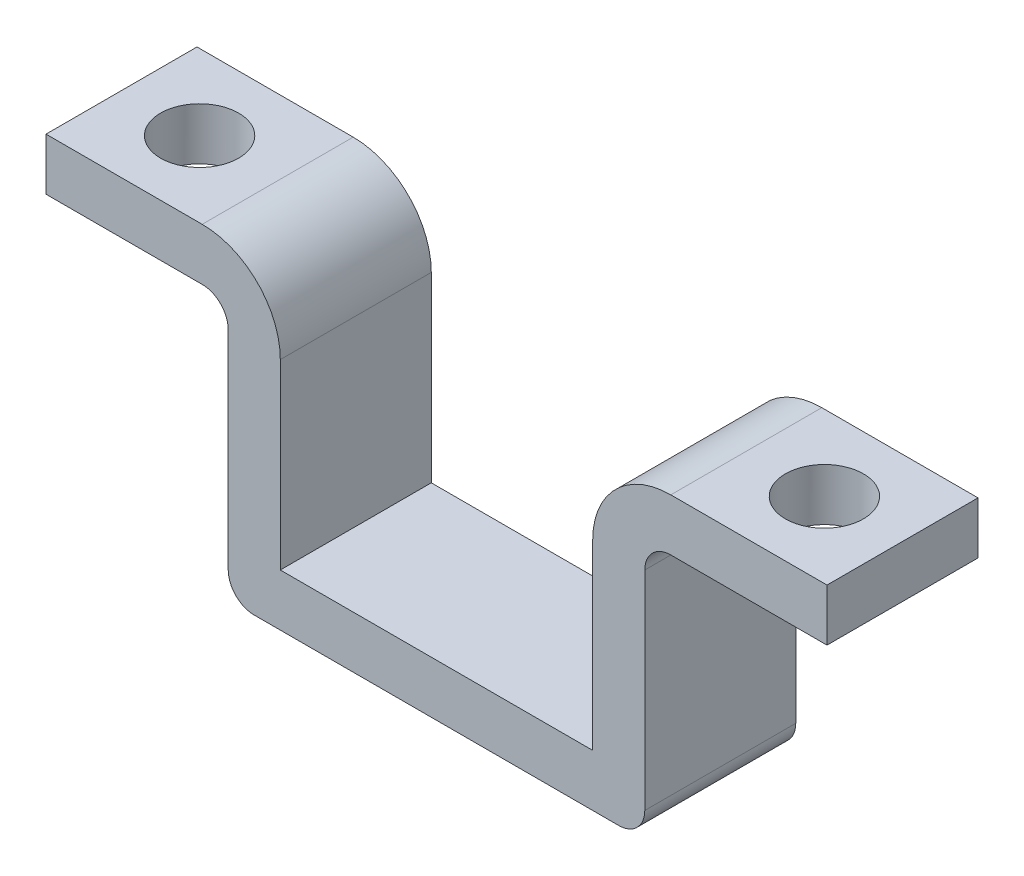
ISO-10303-21;
HEADER;
FILE_DESCRIPTION(('STEP AP214'),'2;1');
FILE_NAME('part.step','',(''),(''),'','','');
FILE_SCHEMA(('AUTOMOTIVE_DESIGN { 1 0 10303 214 1 1 1 1 }'));
ENDSEC;
DATA;
#1=APPLICATION_CONTEXT('core data for automotive mechanical design processes');
#2=APPLICATION_PROTOCOL_DEFINITION('international standard','automotive_design',2000,#1);
#3=PRODUCT_CONTEXT('',#1,'mechanical');
#4=PRODUCT('Part','Part','',(#3));
#5=PRODUCT_RELATED_PRODUCT_CATEGORY('part','',(#4));
#6=PRODUCT_DEFINITION_FORMATION('','',#4);
#7=PRODUCT_DEFINITION_CONTEXT('part definition',#1,'design');
#8=PRODUCT_DEFINITION('design','',#6,#7);
#9=PRODUCT_DEFINITION_SHAPE('','',#8);
#10=(LENGTH_UNIT() NAMED_UNIT(*) SI_UNIT(.MILLI.,.METRE.));
#11=(NAMED_UNIT(*) PLANE_ANGLE_UNIT() SI_UNIT($,.RADIAN.));
#12=(NAMED_UNIT(*) SI_UNIT($,.STERADIAN.) SOLID_ANGLE_UNIT());
#13=UNCERTAINTY_MEASURE_WITH_UNIT(LENGTH_MEASURE(1.E-05),#10,'distance_accuracy_value','');
#14=(GEOMETRIC_REPRESENTATION_CONTEXT(3) GLOBAL_UNCERTAINTY_ASSIGNED_CONTEXT((#13)) GLOBAL_UNIT_ASSIGNED_CONTEXT((#10,
#11,#12)) REPRESENTATION_CONTEXT('',''));
#15=CARTESIAN_POINT('',(0.,0.,0.));
#16=DIRECTION('',(0.,0.,1.));
#17=DIRECTION('',(1.,0.,0.));
#18=AXIS2_PLACEMENT_3D('',#15,#16,#17);
#19=CARTESIAN_POINT('',(-6.,-5.,2.9));
#20=DIRECTION('',(-1.,0.,0.));
#21=DIRECTION('',(0.,0.,1.));
#22=AXIS2_PLACEMENT_3D('',#19,#20,#21);
#23=PLANE('',#22);
#24=DIRECTION('',(0.,1.,0.));
#25=VECTOR('',#24,1.);
#26=CARTESIAN_POINT('',(-6.,-5.,-2.9));
#27=LINE('',#26,#25);
#28=CARTESIAN_POINT('',(-6.,-5.,-2.9));
#29=VERTEX_POINT('',#28);
#30=CARTESIAN_POINT('',(-6.,2.,-2.9));
#31=VERTEX_POINT('',#30);
#32=EDGE_CURVE('E189',#29,#31,#27,.T.);
#33=ORIENTED_EDGE('',*,*,#32,.T.);
#34=DIRECTION('',(0.,0.,-1.));
#35=VECTOR('',#34,1.);
#36=CARTESIAN_POINT('',(-6.,2.,2.9));
#37=LINE('',#36,#35);
#38=CARTESIAN_POINT('',(-6.,2.,2.9));
#39=VERTEX_POINT('',#38);
#40=EDGE_CURVE('E11',#39,#31,#37,.T.);
#41=ORIENTED_EDGE('',*,*,#40,.F.);
#42=DIRECTION('',(0.,1.,0.));
#43=VECTOR('',#42,1.);
#44=CARTESIAN_POINT('',(-6.,-5.,2.9));
#45=LINE('',#44,#43);
#46=CARTESIAN_POINT('',(-6.,-5.,2.9));
#47=VERTEX_POINT('',#46);
#48=EDGE_CURVE('E223',#47,#39,#45,.T.);
#49=ORIENTED_EDGE('',*,*,#48,.F.);
#50=DIRECTION('',(0.,0.,-1.));
#51=VECTOR('',#50,1.);
#52=CARTESIAN_POINT('',(-6.,-5.,2.9));
#53=LINE('',#52,#51);
#54=EDGE_CURVE('E185',#47,#29,#53,.T.);
#55=ORIENTED_EDGE('',*,*,#54,.T.);
#56=EDGE_LOOP('',(#33,#41,#49,#55));
#57=FACE_BOUND('',#56,.T.);
#58=ADVANCED_FACE('F32',(#57),#23,.F.);
#59=CARTESIAN_POINT('',(-9.00000000000001,2.,2.9));
#60=DIRECTION('',(0.,0.,-1.));
#61=DIRECTION('',(-1.,0.,0.));
#62=AXIS2_PLACEMENT_3D('',#59,#60,#61);
#63=CYLINDRICAL_SURFACE('',#62,3.);
#64=CARTESIAN_POINT('',(-9.00000000000001,2.,-2.9));
#65=DIRECTION('',(0.,0.,1.));
#66=DIRECTION('',(1.,0.,0.));
#67=AXIS2_PLACEMENT_3D('',#64,#65,#66);
#68=CIRCLE('',#67,3.);
#69=CARTESIAN_POINT('',(-9.00000000000001,5.,-2.9));
#70=VERTEX_POINT('',#69);
#71=EDGE_CURVE('E192',#31,#70,#68,.T.);
#72=ORIENTED_EDGE('',*,*,#71,.T.);
#73=DIRECTION('',(0.,0.,-1.));
#74=VECTOR('',#73,1.);
#75=CARTESIAN_POINT('',(-9.00000000000001,5.,2.9));
#76=LINE('',#75,#74);
#77=CARTESIAN_POINT('',(-9.00000000000001,5.,2.9));
#78=VERTEX_POINT('',#77);
#79=EDGE_CURVE('E41',#78,#70,#76,.T.);
#80=ORIENTED_EDGE('',*,*,#79,.F.);
#81=CARTESIAN_POINT('',(-9.00000000000001,2.,2.9));
#82=DIRECTION('',(0.,0.,1.));
#83=DIRECTION('',(1.,0.,0.));
#84=AXIS2_PLACEMENT_3D('',#81,#82,#83);
#85=CIRCLE('',#84,3.);
#86=EDGE_CURVE('E122',#39,#78,#85,.T.);
#87=ORIENTED_EDGE('',*,*,#86,.F.);
#88=ORIENTED_EDGE('',*,*,#40,.T.);
#89=EDGE_LOOP('',(#72,#80,#87,#88));
#90=FACE_BOUND('',#89,.T.);
#91=ADVANCED_FACE('F332',(#90),#63,.T.);
#92=CARTESIAN_POINT('',(-15.,5.,2.9));
#93=DIRECTION('',(0.,-1.,0.));
#94=DIRECTION('',(0.,0.,-1.));
#95=AXIS2_PLACEMENT_3D('',#92,#93,#94);
#96=PLANE('',#95);
#97=CARTESIAN_POINT('',(-12.,5.,0.));
#98=DIRECTION('',(0.,1.,0.));
#99=DIRECTION('',(0.,0.,1.));
#100=AXIS2_PLACEMENT_3D('',#97,#98,#99);
#101=CIRCLE('',#100,1.5);
#102=CARTESIAN_POINT('',(-12.,5.,1.5));
#103=VERTEX_POINT('',#102);
#104=EDGE_CURVE('E465',#103,#103,#101,.T.);
#105=ORIENTED_EDGE('',*,*,#104,.F.);
#106=EDGE_LOOP('',(#105));
#107=FACE_BOUND('',#106,.T.);
#108=DIRECTION('',(-1.,0.,0.));
#109=VECTOR('',#108,1.);
#110=CARTESIAN_POINT('',(-15.,5.,-2.9));
#111=LINE('',#110,#109);
#112=CARTESIAN_POINT('',(-15.,5.,-2.9));
#113=VERTEX_POINT('',#112);
#114=EDGE_CURVE('E194',#70,#113,#111,.T.);
#115=ORIENTED_EDGE('',*,*,#114,.T.);
#116=DIRECTION('',(0.,0.,-1.));
#117=VECTOR('',#116,1.);
#118=CARTESIAN_POINT('',(-15.,5.,2.9));
#119=LINE('',#118,#117);
#120=CARTESIAN_POINT('',(-15.,5.,2.9));
#121=VERTEX_POINT('',#120);
#122=EDGE_CURVE('E260',#121,#113,#119,.T.);
#123=ORIENTED_EDGE('',*,*,#122,.F.);
#124=DIRECTION('',(-1.,0.,0.));
#125=VECTOR('',#124,1.);
#126=CARTESIAN_POINT('',(-15.,5.,2.9));
#127=LINE('',#126,#125);
#128=EDGE_CURVE('E269',#78,#121,#127,.T.);
#129=ORIENTED_EDGE('',*,*,#128,.F.);
#130=ORIENTED_EDGE('',*,*,#79,.T.);
#131=EDGE_LOOP('',(#115,#123,#129,#130));
#132=FACE_BOUND('',#131,.T.);
#133=ADVANCED_FACE('F267',(#107,#132),#96,.F.);
#134=CARTESIAN_POINT('',(-15.,3.,2.9));
#135=DIRECTION('',(1.,0.,0.));
#136=DIRECTION('',(0.,0.,-1.));
#137=AXIS2_PLACEMENT_3D('',#134,#135,#136);
#138=PLANE('',#137);
#139=DIRECTION('',(0.,-1.,0.));
#140=VECTOR('',#139,1.);
#141=CARTESIAN_POINT('',(-15.,3.,-2.9));
#142=LINE('',#141,#140);
#143=CARTESIAN_POINT('',(-15.,3.,-2.9));
#144=VERTEX_POINT('',#143);
#145=EDGE_CURVE('E196',#113,#144,#142,.T.);
#146=ORIENTED_EDGE('',*,*,#145,.T.);
#147=DIRECTION('',(0.,0.,-1.));
#148=VECTOR('',#147,1.);
#149=CARTESIAN_POINT('',(-15.,3.,2.9));
#150=LINE('',#149,#148);
#151=CARTESIAN_POINT('',(-15.,3.,2.9));
#152=VERTEX_POINT('',#151);
#153=EDGE_CURVE('E257',#152,#144,#150,.T.);
#154=ORIENTED_EDGE('',*,*,#153,.F.);
#155=DIRECTION('',(0.,-1.,0.));
#156=VECTOR('',#155,1.);
#157=CARTESIAN_POINT('',(-15.,3.,2.9));
#158=LINE('',#157,#156);
#159=EDGE_CURVE('E287',#121,#152,#158,.T.);
#160=ORIENTED_EDGE('',*,*,#159,.F.);
#161=ORIENTED_EDGE('',*,*,#122,.T.);
#162=EDGE_LOOP('',(#146,#154,#160,#161));
#163=FACE_BOUND('',#162,.T.);
#164=ADVANCED_FACE('F278',(#163),#138,.F.);
#165=CARTESIAN_POINT('',(-9.00000000000001,3.,2.9));
#166=DIRECTION('',(0.,1.,0.));
#167=DIRECTION('',(-1.,0.,0.));
#168=AXIS2_PLACEMENT_3D('',#165,#166,#167);
#169=PLANE('',#168);
#170=CARTESIAN_POINT('',(-12.,3.,0.));
#171=DIRECTION('',(0.,1.,0.));
#172=DIRECTION('',(-1.,0.,0.));
#173=AXIS2_PLACEMENT_3D('',#170,#171,#172);
#174=CIRCLE('',#173,1.5);
#175=CARTESIAN_POINT('',(-13.5,3.,0.));
#176=VERTEX_POINT('',#175);
#177=EDGE_CURVE('E35',#176,#176,#174,.T.);
#178=ORIENTED_EDGE('',*,*,#177,.T.);
#179=EDGE_LOOP('',(#178));
#180=FACE_BOUND('',#179,.T.);
#181=DIRECTION('',(1.,0.,0.));
#182=VECTOR('',#181,1.);
#183=CARTESIAN_POINT('',(-9.00000000000001,3.,-2.9));
#184=LINE('',#183,#182);
#185=CARTESIAN_POINT('',(-9.00000000000001,3.,-2.9));
#186=VERTEX_POINT('',#185);
#187=EDGE_CURVE('E198',#144,#186,#184,.T.);
#188=ORIENTED_EDGE('',*,*,#187,.T.);
#189=DIRECTION('',(0.,0.,-1.));
#190=VECTOR('',#189,1.);
#191=CARTESIAN_POINT('',(-9.00000000000001,3.,2.9));
#192=LINE('',#191,#190);
#193=CARTESIAN_POINT('',(-9.00000000000001,3.,2.9));
#194=VERTEX_POINT('',#193);
#195=EDGE_CURVE('E254',#194,#186,#192,.T.);
#196=ORIENTED_EDGE('',*,*,#195,.F.);
#197=DIRECTION('',(1.,0.,0.));
#198=VECTOR('',#197,1.);
#199=CARTESIAN_POINT('',(-9.00000000000001,3.,2.9));
#200=LINE('',#199,#198);
#201=EDGE_CURVE('E284',#152,#194,#200,.T.);
#202=ORIENTED_EDGE('',*,*,#201,.F.);
#203=ORIENTED_EDGE('',*,*,#153,.T.);
#204=EDGE_LOOP('',(#188,#196,#202,#203));
#205=FACE_BOUND('',#204,.T.);
#206=ADVANCED_FACE('F282',(#180,#205),#169,.F.);
#207=CARTESIAN_POINT('',(-9.00000000000001,2.,2.9));
#208=DIRECTION('',(0.,0.,-1.));
#209=DIRECTION('',(-1.,0.,0.));
#210=AXIS2_PLACEMENT_3D('',#207,#208,#209);
#211=CYLINDRICAL_SURFACE('',#210,1.);
#212=CARTESIAN_POINT('',(-9.00000000000001,2.,-2.9));
#213=DIRECTION('',(0.,0.,-1.));
#214=DIRECTION('',(1.,0.,0.));
#215=AXIS2_PLACEMENT_3D('',#212,#213,#214);
#216=CIRCLE('',#215,1.);
#217=CARTESIAN_POINT('',(-8.,2.,-2.9));
#218=VERTEX_POINT('',#217);
#219=EDGE_CURVE('E200',#186,#218,#216,.T.);
#220=ORIENTED_EDGE('',*,*,#219,.T.);
#221=DIRECTION('',(0.,0.,-1.));
#222=VECTOR('',#221,1.);
#223=CARTESIAN_POINT('',(-8.,2.,2.9));
#224=LINE('',#223,#222);
#225=CARTESIAN_POINT('',(-8.,2.,2.9));
#226=VERTEX_POINT('',#225);
#227=EDGE_CURVE('E251',#226,#218,#224,.T.);
#228=ORIENTED_EDGE('',*,*,#227,.F.);
#229=CARTESIAN_POINT('',(-9.00000000000001,2.,2.9));
#230=DIRECTION('',(0.,0.,-1.));
#231=DIRECTION('',(1.,0.,0.));
#232=AXIS2_PLACEMENT_3D('',#229,#230,#231);
#233=CIRCLE('',#232,1.);
#234=EDGE_CURVE('E286',#194,#226,#233,.T.);
#235=ORIENTED_EDGE('',*,*,#234,.F.);
#236=ORIENTED_EDGE('',*,*,#195,.T.);
#237=EDGE_LOOP('',(#220,#228,#235,#236));
#238=FACE_BOUND('',#237,.T.);
#239=ADVANCED_FACE('F346',(#238),#211,.F.);
#240=CARTESIAN_POINT('',(-8.,-5.99999999999999,2.9));
#241=DIRECTION('',(1.,0.,0.));
#242=DIRECTION('',(0.,0.,-1.));
#243=AXIS2_PLACEMENT_3D('',#240,#241,#242);
#244=PLANE('',#243);
#245=DIRECTION('',(0.,-1.,0.));
#246=VECTOR('',#245,1.);
#247=CARTESIAN_POINT('',(-8.,-5.99999999999999,-2.9));
#248=LINE('',#247,#246);
#249=CARTESIAN_POINT('',(-8.,-6.,-2.9));
#250=VERTEX_POINT('',#249);
#251=EDGE_CURVE('E202',#218,#250,#248,.T.);
#252=ORIENTED_EDGE('',*,*,#251,.T.);
#253=DIRECTION('',(0.,0.,-1.));
#254=VECTOR('',#253,1.);
#255=CARTESIAN_POINT('',(-8.,-6.,2.9));
#256=LINE('',#255,#254);
#257=CARTESIAN_POINT('',(-8.,-6.,2.9));
#258=VERTEX_POINT('',#257);
#259=EDGE_CURVE('E248',#258,#250,#256,.T.);
#260=ORIENTED_EDGE('',*,*,#259,.F.);
#261=DIRECTION('',(0.,-1.,0.));
#262=VECTOR('',#261,1.);
#263=CARTESIAN_POINT('',(-8.,-5.99999999999999,2.9));
#264=LINE('',#263,#262);
#265=EDGE_CURVE('E289',#226,#258,#264,.T.);
#266=ORIENTED_EDGE('',*,*,#265,.F.);
#267=ORIENTED_EDGE('',*,*,#227,.T.);
#268=EDGE_LOOP('',(#252,#260,#266,#267));
#269=FACE_BOUND('',#268,.T.);
#270=ADVANCED_FACE('F350',(#269),#244,.F.);
#271=CARTESIAN_POINT('',(-7.,-6.,2.9));
#272=DIRECTION('',(0.,0.,-1.));
#273=DIRECTION('',(-1.,0.,0.));
#274=AXIS2_PLACEMENT_3D('',#271,#272,#273);
#275=CYLINDRICAL_SURFACE('',#274,1.);
#276=CARTESIAN_POINT('',(-7.,-6.,-2.9));
#277=DIRECTION('',(0.,0.,1.));
#278=DIRECTION('',(-1.,0.,0.));
#279=AXIS2_PLACEMENT_3D('',#276,#277,#278);
#280=CIRCLE('',#279,1.);
#281=CARTESIAN_POINT('',(-7.,-7.,-2.9));
#282=VERTEX_POINT('',#281);
#283=EDGE_CURVE('E204',#250,#282,#280,.T.);
#284=ORIENTED_EDGE('',*,*,#283,.T.);
#285=DIRECTION('',(0.,0.,-1.));
#286=VECTOR('',#285,1.);
#287=CARTESIAN_POINT('',(-7.,-7.,2.9));
#288=LINE('',#287,#286);
#289=CARTESIAN_POINT('',(-7.,-7.,2.9));
#290=VERTEX_POINT('',#289);
#291=EDGE_CURVE('E245',#290,#282,#288,.T.);
#292=ORIENTED_EDGE('',*,*,#291,.F.);
#293=CARTESIAN_POINT('',(-7.,-6.,2.9));
#294=DIRECTION('',(0.,0.,1.));
#295=DIRECTION('',(-1.,0.,0.));
#296=AXIS2_PLACEMENT_3D('',#293,#294,#295);
#297=CIRCLE('',#296,1.);
#298=EDGE_CURVE('E295',#258,#290,#297,.T.);
#299=ORIENTED_EDGE('',*,*,#298,.F.);
#300=ORIENTED_EDGE('',*,*,#259,.T.);
#301=EDGE_LOOP('',(#284,#292,#299,#300));
#302=FACE_BOUND('',#301,.T.);
#303=ADVANCED_FACE('F354',(#302),#275,.T.);
#304=CARTESIAN_POINT('',(-7.,-7.,2.9));
#305=DIRECTION('',(0.,1.,0.));
#306=DIRECTION('',(0.,0.,1.));
#307=AXIS2_PLACEMENT_3D('',#304,#305,#306);
#308=PLANE('',#307);
#309=DIRECTION('',(1.,0.,0.));
#310=VECTOR('',#309,1.);
#311=CARTESIAN_POINT('',(-7.,-7.,-2.9));
#312=LINE('',#311,#310);
#313=CARTESIAN_POINT('',(7.,-7.,-2.9));
#314=VERTEX_POINT('',#313);
#315=EDGE_CURVE('E206',#282,#314,#312,.T.);
#316=ORIENTED_EDGE('',*,*,#315,.T.);
#317=DIRECTION('',(0.,0.,-1.));
#318=VECTOR('',#317,1.);
#319=CARTESIAN_POINT('',(7.,-7.,2.9));
#320=LINE('',#319,#318);
#321=CARTESIAN_POINT('',(7.,-7.,2.9));
#322=VERTEX_POINT('',#321);
#323=EDGE_CURVE('E242',#322,#314,#320,.T.);
#324=ORIENTED_EDGE('',*,*,#323,.F.);
#325=DIRECTION('',(1.,0.,0.));
#326=VECTOR('',#325,1.);
#327=CARTESIAN_POINT('',(-7.,-7.,2.9));
#328=LINE('',#327,#326);
#329=EDGE_CURVE('E297',#290,#322,#328,.T.);
#330=ORIENTED_EDGE('',*,*,#329,.F.);
#331=ORIENTED_EDGE('',*,*,#291,.T.);
#332=EDGE_LOOP('',(#316,#324,#330,#331));
#333=FACE_BOUND('',#332,.T.);
#334=ADVANCED_FACE('F358',(#333),#308,.F.);
#335=CARTESIAN_POINT('',(7.,-6.,2.9));
#336=DIRECTION('',(0.,0.,-1.));
#337=DIRECTION('',(-1.,0.,0.));
#338=AXIS2_PLACEMENT_3D('',#335,#336,#337);
#339=CYLINDRICAL_SURFACE('',#338,1.);
#340=CARTESIAN_POINT('',(7.,-6.,-2.9));
#341=DIRECTION('',(0.,0.,1.));
#342=DIRECTION('',(-1.,0.,0.));
#343=AXIS2_PLACEMENT_3D('',#340,#341,#342);
#344=CIRCLE('',#343,1.);
#345=CARTESIAN_POINT('',(8.,-5.99999999999999,-2.9));
#346=VERTEX_POINT('',#345);
#347=EDGE_CURVE('E208',#314,#346,#344,.T.);
#348=ORIENTED_EDGE('',*,*,#347,.T.);
#349=DIRECTION('',(0.,0.,-1.));
#350=VECTOR('',#349,1.);
#351=CARTESIAN_POINT('',(8.,-5.99999999999999,2.9));
#352=LINE('',#351,#350);
#353=CARTESIAN_POINT('',(8.,-5.99999999999999,2.9));
#354=VERTEX_POINT('',#353);
#355=EDGE_CURVE('E239',#354,#346,#352,.T.);
#356=ORIENTED_EDGE('',*,*,#355,.F.);
#357=CARTESIAN_POINT('',(7.,-6.,2.9));
#358=DIRECTION('',(0.,0.,1.));
#359=DIRECTION('',(-1.,0.,0.));
#360=AXIS2_PLACEMENT_3D('',#357,#358,#359);
#361=CIRCLE('',#360,1.);
#362=EDGE_CURVE('E299',#322,#354,#361,.T.);
#363=ORIENTED_EDGE('',*,*,#362,.F.);
#364=ORIENTED_EDGE('',*,*,#323,.T.);
#365=EDGE_LOOP('',(#348,#356,#363,#364));
#366=FACE_BOUND('',#365,.T.);
#367=ADVANCED_FACE('F362',(#366),#339,.T.);
#368=CARTESIAN_POINT('',(8.,-5.99999999999999,2.9));
#369=DIRECTION('',(-1.,0.,0.));
#370=DIRECTION('',(0.,0.,1.));
#371=AXIS2_PLACEMENT_3D('',#368,#369,#370);
#372=PLANE('',#371);
#373=DIRECTION('',(0.,1.,0.));
#374=VECTOR('',#373,1.);
#375=CARTESIAN_POINT('',(8.,-5.99999999999999,-2.9));
#376=LINE('',#375,#374);
#377=CARTESIAN_POINT('',(8.,2.,-2.9));
#378=VERTEX_POINT('',#377);
#379=EDGE_CURVE('E210',#346,#378,#376,.T.);
#380=ORIENTED_EDGE('',*,*,#379,.T.);
#381=DIRECTION('',(0.,0.,-1.));
#382=VECTOR('',#381,1.);
#383=CARTESIAN_POINT('',(8.,2.,2.9));
#384=LINE('',#383,#382);
#385=CARTESIAN_POINT('',(8.,2.,2.9));
#386=VERTEX_POINT('',#385);
#387=EDGE_CURVE('E236',#386,#378,#384,.T.);
#388=ORIENTED_EDGE('',*,*,#387,.F.);
#389=DIRECTION('',(0.,1.,0.));
#390=VECTOR('',#389,1.);
#391=CARTESIAN_POINT('',(8.,-5.99999999999999,2.9));
#392=LINE('',#391,#390);
#393=EDGE_CURVE('E301',#354,#386,#392,.T.);
#394=ORIENTED_EDGE('',*,*,#393,.F.);
#395=ORIENTED_EDGE('',*,*,#355,.T.);
#396=EDGE_LOOP('',(#380,#388,#394,#395));
#397=FACE_BOUND('',#396,.T.);
#398=ADVANCED_FACE('F366',(#397),#372,.F.);
#399=CARTESIAN_POINT('',(9.00000000000001,2.,2.9));
#400=DIRECTION('',(0.,0.,-1.));
#401=DIRECTION('',(-1.,0.,0.));
#402=AXIS2_PLACEMENT_3D('',#399,#400,#401);
#403=CYLINDRICAL_SURFACE('',#402,1.);
#404=CARTESIAN_POINT('',(9.00000000000001,2.,-2.9));
#405=DIRECTION('',(0.,0.,-1.));
#406=DIRECTION('',(1.,0.,0.));
#407=AXIS2_PLACEMENT_3D('',#404,#405,#406);
#408=CIRCLE('',#407,1.);
#409=CARTESIAN_POINT('',(9.00000000000001,3.,-2.9));
#410=VERTEX_POINT('',#409);
#411=EDGE_CURVE('E212',#378,#410,#408,.T.);
#412=ORIENTED_EDGE('',*,*,#411,.T.);
#413=DIRECTION('',(0.,0.,-1.));
#414=VECTOR('',#413,1.);
#415=CARTESIAN_POINT('',(9.00000000000001,3.,2.9));
#416=LINE('',#415,#414);
#417=CARTESIAN_POINT('',(9.00000000000001,3.,2.9));
#418=VERTEX_POINT('',#417);
#419=EDGE_CURVE('E233',#418,#410,#416,.T.);
#420=ORIENTED_EDGE('',*,*,#419,.F.);
#421=CARTESIAN_POINT('',(9.00000000000001,2.,2.9));
#422=DIRECTION('',(0.,0.,-1.));
#423=DIRECTION('',(1.,0.,0.));
#424=AXIS2_PLACEMENT_3D('',#421,#422,#423);
#425=CIRCLE('',#424,1.);
#426=EDGE_CURVE('E303',#386,#418,#425,.T.);
#427=ORIENTED_EDGE('',*,*,#426,.F.);
#428=ORIENTED_EDGE('',*,*,#387,.T.);
#429=EDGE_LOOP('',(#412,#420,#427,#428));
#430=FACE_BOUND('',#429,.T.);
#431=ADVANCED_FACE('F370',(#430),#403,.F.);
#432=CARTESIAN_POINT('',(15.,3.,2.9));
#433=DIRECTION('',(0.,1.,0.));
#434=DIRECTION('',(-1.,0.,0.));
#435=AXIS2_PLACEMENT_3D('',#432,#433,#434);
#436=PLANE('',#435);
#437=CARTESIAN_POINT('',(12.,3.,0.));
#438=DIRECTION('',(0.,1.,0.));
#439=DIRECTION('',(-1.,0.,0.));
#440=AXIS2_PLACEMENT_3D('',#437,#438,#439);
#441=CIRCLE('',#440,1.5);
#442=CARTESIAN_POINT('',(10.5,3.,0.));
#443=VERTEX_POINT('',#442);
#444=EDGE_CURVE('E468',#443,#443,#441,.T.);
#445=ORIENTED_EDGE('',*,*,#444,.T.);
#446=EDGE_LOOP('',(#445));
#447=FACE_BOUND('',#446,.T.);
#448=DIRECTION('',(1.,0.,0.));
#449=VECTOR('',#448,1.);
#450=CARTESIAN_POINT('',(15.,3.,-2.9));
#451=LINE('',#450,#449);
#452=CARTESIAN_POINT('',(15.,3.,-2.9));
#453=VERTEX_POINT('',#452);
#454=EDGE_CURVE('E214',#410,#453,#451,.T.);
#455=ORIENTED_EDGE('',*,*,#454,.T.);
#456=DIRECTION('',(0.,0.,-1.));
#457=VECTOR('',#456,1.);
#458=CARTESIAN_POINT('',(15.,3.,2.9));
#459=LINE('',#458,#457);
#460=CARTESIAN_POINT('',(15.,3.,2.9));
#461=VERTEX_POINT('',#460);
#462=EDGE_CURVE('E230',#461,#453,#459,.T.);
#463=ORIENTED_EDGE('',*,*,#462,.F.);
#464=DIRECTION('',(1.,0.,0.));
#465=VECTOR('',#464,1.);
#466=CARTESIAN_POINT('',(15.,3.,2.9));
#467=LINE('',#466,#465);
#468=EDGE_CURVE('E305',#418,#461,#467,.T.);
#469=ORIENTED_EDGE('',*,*,#468,.F.);
#470=ORIENTED_EDGE('',*,*,#419,.T.);
#471=EDGE_LOOP('',(#455,#463,#469,#470));
#472=FACE_BOUND('',#471,.T.);
#473=ADVANCED_FACE('F374',(#447,#472),#436,.F.);
#474=CARTESIAN_POINT('',(15.,5.,2.9));
#475=DIRECTION('',(-1.,0.,0.));
#476=DIRECTION('',(0.,-1.,0.));
#477=AXIS2_PLACEMENT_3D('',#474,#475,#476);
#478=PLANE('',#477);
#479=DIRECTION('',(0.,1.,0.));
#480=VECTOR('',#479,1.);
#481=CARTESIAN_POINT('',(15.,5.,-2.9));
#482=LINE('',#481,#480);
#483=CARTESIAN_POINT('',(15.,5.,-2.9));
#484=VERTEX_POINT('',#483);
#485=EDGE_CURVE('E216',#453,#484,#482,.T.);
#486=ORIENTED_EDGE('',*,*,#485,.T.);
#487=DIRECTION('',(0.,0.,-1.));
#488=VECTOR('',#487,1.);
#489=CARTESIAN_POINT('',(15.,5.,2.9));
#490=LINE('',#489,#488);
#491=CARTESIAN_POINT('',(15.,5.,2.9));
#492=VERTEX_POINT('',#491);
#493=EDGE_CURVE('E227',#492,#484,#490,.T.);
#494=ORIENTED_EDGE('',*,*,#493,.F.);
#495=DIRECTION('',(0.,1.,0.));
#496=VECTOR('',#495,1.);
#497=CARTESIAN_POINT('',(15.,5.,2.9));
#498=LINE('',#497,#496);
#499=EDGE_CURVE('E307',#461,#492,#498,.T.);
#500=ORIENTED_EDGE('',*,*,#499,.F.);
#501=ORIENTED_EDGE('',*,*,#462,.T.);
#502=EDGE_LOOP('',(#486,#494,#500,#501));
#503=FACE_BOUND('',#502,.T.);
#504=ADVANCED_FACE('F313',(#503),#478,.F.);
#505=CARTESIAN_POINT('',(9.00000000000001,5.,2.9));
#506=DIRECTION('',(0.,-1.,0.));
#507=DIRECTION('',(0.,0.,-1.));
#508=AXIS2_PLACEMENT_3D('',#505,#506,#507);
#509=PLANE('',#508);
#510=CARTESIAN_POINT('',(12.,5.,0.));
#511=DIRECTION('',(0.,1.,0.));
#512=DIRECTION('',(0.,0.,1.));
#513=AXIS2_PLACEMENT_3D('',#510,#511,#512);
#514=CIRCLE('',#513,1.5);
#515=CARTESIAN_POINT('',(12.,5.,1.5));
#516=VERTEX_POINT('',#515);
#517=EDGE_CURVE('E470',#516,#516,#514,.T.);
#518=ORIENTED_EDGE('',*,*,#517,.F.);
#519=EDGE_LOOP('',(#518));
#520=FACE_BOUND('',#519,.T.);
#521=DIRECTION('',(-1.,0.,0.));
#522=VECTOR('',#521,1.);
#523=CARTESIAN_POINT('',(9.00000000000001,5.,-2.9));
#524=LINE('',#523,#522);
#525=CARTESIAN_POINT('',(9.00000000000001,5.,-2.9));
#526=VERTEX_POINT('',#525);
#527=EDGE_CURVE('E218',#484,#526,#524,.T.);
#528=ORIENTED_EDGE('',*,*,#527,.T.);
#529=DIRECTION('',(0.,0.,-1.));
#530=VECTOR('',#529,1.);
#531=CARTESIAN_POINT('',(9.00000000000001,5.,2.9));
#532=LINE('',#531,#530);
#533=CARTESIAN_POINT('',(9.00000000000001,5.,2.9));
#534=VERTEX_POINT('',#533);
#535=EDGE_CURVE('E180',#534,#526,#532,.T.);
#536=ORIENTED_EDGE('',*,*,#535,.F.);
#537=DIRECTION('',(-1.,0.,0.));
#538=VECTOR('',#537,1.);
#539=CARTESIAN_POINT('',(9.00000000000001,5.,2.9));
#540=LINE('',#539,#538);
#541=EDGE_CURVE('E171',#492,#534,#540,.T.);
#542=ORIENTED_EDGE('',*,*,#541,.F.);
#543=ORIENTED_EDGE('',*,*,#493,.T.);
#544=EDGE_LOOP('',(#528,#536,#542,#543));
#545=FACE_BOUND('',#544,.T.);
#546=ADVANCED_FACE('F317',(#520,#545),#509,.F.);
#547=CARTESIAN_POINT('',(9.00000000000001,2.,2.9));
#548=DIRECTION('',(0.,0.,-1.));
#549=DIRECTION('',(-1.,0.,0.));
#550=AXIS2_PLACEMENT_3D('',#547,#548,#549);
#551=CYLINDRICAL_SURFACE('',#550,3.);
#552=CARTESIAN_POINT('',(9.00000000000001,2.,-2.9));
#553=DIRECTION('',(0.,0.,1.));
#554=DIRECTION('',(1.,0.,0.));
#555=AXIS2_PLACEMENT_3D('',#552,#553,#554);
#556=CIRCLE('',#555,3.);
#557=CARTESIAN_POINT('',(6.,2.,-2.9));
#558=VERTEX_POINT('',#557);
#559=EDGE_CURVE('E179',#526,#558,#556,.T.);
#560=ORIENTED_EDGE('',*,*,#559,.T.);
#561=DIRECTION('',(0.,0.,-1.));
#562=VECTOR('',#561,1.);
#563=CARTESIAN_POINT('',(6.,2.,2.9));
#564=LINE('',#563,#562);
#565=CARTESIAN_POINT('',(6.,2.,2.9));
#566=VERTEX_POINT('',#565);
#567=EDGE_CURVE('E176',#566,#558,#564,.T.);
#568=ORIENTED_EDGE('',*,*,#567,.F.);
#569=CARTESIAN_POINT('',(9.00000000000001,2.,2.9));
#570=DIRECTION('',(0.,0.,1.));
#571=DIRECTION('',(1.,0.,0.));
#572=AXIS2_PLACEMENT_3D('',#569,#570,#571);
#573=CIRCLE('',#572,3.);
#574=EDGE_CURVE('E165',#534,#566,#573,.T.);
#575=ORIENTED_EDGE('',*,*,#574,.F.);
#576=ORIENTED_EDGE('',*,*,#535,.T.);
#577=EDGE_LOOP('',(#560,#568,#575,#576));
#578=FACE_BOUND('',#577,.T.);
#579=ADVANCED_FACE('F177',(#578),#551,.T.);
#580=CARTESIAN_POINT('',(6.,-5.,2.9));
#581=DIRECTION('',(1.,0.,0.));
#582=DIRECTION('',(0.,0.,-1.));
#583=AXIS2_PLACEMENT_3D('',#580,#581,#582);
#584=PLANE('',#583);
#585=DIRECTION('',(0.,-1.,0.));
#586=VECTOR('',#585,1.);
#587=CARTESIAN_POINT('',(6.,-5.,-2.9));
#588=LINE('',#587,#586);
#589=CARTESIAN_POINT('',(6.,-5.,-2.9));
#590=VERTEX_POINT('',#589);
#591=EDGE_CURVE('E108',#558,#590,#588,.T.);
#592=ORIENTED_EDGE('',*,*,#591,.T.);
#593=DIRECTION('',(0.,0.,-1.));
#594=VECTOR('',#593,1.);
#595=CARTESIAN_POINT('',(6.,-5.,2.9));
#596=LINE('',#595,#594);
#597=CARTESIAN_POINT('',(6.,-5.,2.9));
#598=VERTEX_POINT('',#597);
#599=EDGE_CURVE('E181',#598,#590,#596,.T.);
#600=ORIENTED_EDGE('',*,*,#599,.F.);
#601=DIRECTION('',(0.,-1.,0.));
#602=VECTOR('',#601,1.);
#603=CARTESIAN_POINT('',(6.,-5.,2.9));
#604=LINE('',#603,#602);
#605=EDGE_CURVE('E169',#566,#598,#604,.T.);
#606=ORIENTED_EDGE('',*,*,#605,.F.);
#607=ORIENTED_EDGE('',*,*,#567,.T.);
#608=EDGE_LOOP('',(#592,#600,#606,#607));
#609=FACE_BOUND('',#608,.T.);
#610=ADVANCED_FACE('F183',(#609),#584,.F.);
#611=CARTESIAN_POINT('',(-6.,-5.,2.9));
#612=DIRECTION('',(0.,-1.,0.));
#613=DIRECTION('',(1.,0.,0.));
#614=AXIS2_PLACEMENT_3D('',#611,#612,#613);
#615=PLANE('',#614);
#616=DIRECTION('',(-1.,0.,0.));
#617=VECTOR('',#616,1.);
#618=CARTESIAN_POINT('',(-6.,-5.,-2.9));
#619=LINE('',#618,#617);
#620=EDGE_CURVE('E114',#590,#29,#619,.T.);
#621=ORIENTED_EDGE('',*,*,#620,.T.);
#622=ORIENTED_EDGE('',*,*,#54,.F.);
#623=DIRECTION('',(-1.,0.,0.));
#624=VECTOR('',#623,1.);
#625=CARTESIAN_POINT('',(-6.,-5.,2.9));
#626=LINE('',#625,#624);
#627=EDGE_CURVE('E49',#598,#47,#626,.T.);
#628=ORIENTED_EDGE('',*,*,#627,.F.);
#629=ORIENTED_EDGE('',*,*,#599,.T.);
#630=EDGE_LOOP('',(#621,#622,#628,#629));
#631=FACE_BOUND('',#630,.T.);
#632=ADVANCED_FACE('F321',(#631),#615,.F.);
#633=CARTESIAN_POINT('',(-9.00000000000001,2.,2.9));
#634=DIRECTION('',(0.,0.,1.));
#635=DIRECTION('',(1.,0.,0.));
#636=AXIS2_PLACEMENT_3D('',#633,#634,#635);
#637=PLANE('',#636);
#638=ORIENTED_EDGE('',*,*,#48,.T.);
#639=ORIENTED_EDGE('',*,*,#86,.T.);
#640=ORIENTED_EDGE('',*,*,#128,.T.);
#641=ORIENTED_EDGE('',*,*,#159,.T.);
#642=ORIENTED_EDGE('',*,*,#201,.T.);
#643=ORIENTED_EDGE('',*,*,#234,.T.);
#644=ORIENTED_EDGE('',*,*,#265,.T.);
#645=ORIENTED_EDGE('',*,*,#298,.T.);
#646=ORIENTED_EDGE('',*,*,#329,.T.);
#647=ORIENTED_EDGE('',*,*,#362,.T.);
#648=ORIENTED_EDGE('',*,*,#393,.T.);
#649=ORIENTED_EDGE('',*,*,#426,.T.);
#650=ORIENTED_EDGE('',*,*,#468,.T.);
#651=ORIENTED_EDGE('',*,*,#499,.T.);
#652=ORIENTED_EDGE('',*,*,#541,.T.);
#653=ORIENTED_EDGE('',*,*,#574,.T.);
#654=ORIENTED_EDGE('',*,*,#605,.T.);
#655=ORIENTED_EDGE('',*,*,#627,.T.);
#656=EDGE_LOOP('',(#638,#639,#640,#641,#642,#643,#644,#645,#646,#647,#648,#649,#650,#651,#652,
#653,#654,#655));
#657=FACE_BOUND('',#656,.T.);
#658=ADVANCED_FACE('F167',(#657),#637,.T.);
#659=CARTESIAN_POINT('',(-9.00000000000001,2.,-2.9));
#660=DIRECTION('',(0.,0.,1.));
#661=DIRECTION('',(1.,0.,0.));
#662=AXIS2_PLACEMENT_3D('',#659,#660,#661);
#663=PLANE('',#662);
#664=ORIENTED_EDGE('',*,*,#32,.F.);
#665=ORIENTED_EDGE('',*,*,#620,.F.);
#666=ORIENTED_EDGE('',*,*,#591,.F.);
#667=ORIENTED_EDGE('',*,*,#559,.F.);
#668=ORIENTED_EDGE('',*,*,#527,.F.);
#669=ORIENTED_EDGE('',*,*,#485,.F.);
#670=ORIENTED_EDGE('',*,*,#454,.F.);
#671=ORIENTED_EDGE('',*,*,#411,.F.);
#672=ORIENTED_EDGE('',*,*,#379,.F.);
#673=ORIENTED_EDGE('',*,*,#347,.F.);
#674=ORIENTED_EDGE('',*,*,#315,.F.);
#675=ORIENTED_EDGE('',*,*,#283,.F.);
#676=ORIENTED_EDGE('',*,*,#251,.F.);
#677=ORIENTED_EDGE('',*,*,#219,.F.);
#678=ORIENTED_EDGE('',*,*,#187,.F.);
#679=ORIENTED_EDGE('',*,*,#145,.F.);
#680=ORIENTED_EDGE('',*,*,#114,.F.);
#681=ORIENTED_EDGE('',*,*,#71,.F.);
#682=EDGE_LOOP('',(#664,#665,#666,#667,#668,#669,#670,#671,#672,#673,#674,#675,#676,#677,#678,
#679,#680,#681));
#683=FACE_BOUND('',#682,.T.);
#684=ADVANCED_FACE('F273',(#683),#663,.F.);
#685=CARTESIAN_POINT('',(12.,-7.,0.));
#686=DIRECTION('',(0.,1.,0.));
#687=DIRECTION('',(0.,0.,1.));
#688=AXIS2_PLACEMENT_3D('',#685,#686,#687);
#689=CYLINDRICAL_SURFACE('',#688,1.5);
#690=ORIENTED_EDGE('',*,*,#517,.T.);
#691=EDGE_LOOP('',(#690));
#692=FACE_BOUND('',#691,.T.);
#693=ORIENTED_EDGE('',*,*,#444,.F.);
#694=EDGE_LOOP('',(#693));
#695=FACE_BOUND('',#694,.T.);
#696=ADVANCED_FACE('F413',(#692,#695),#689,.F.);
#697=CARTESIAN_POINT('',(-12.,-7.,0.));
#698=DIRECTION('',(0.,1.,0.));
#699=DIRECTION('',(0.,0.,1.));
#700=AXIS2_PLACEMENT_3D('',#697,#698,#699);
#701=CYLINDRICAL_SURFACE('',#700,1.5);
#702=ORIENTED_EDGE('',*,*,#104,.T.);
#703=EDGE_LOOP('',(#702));
#704=FACE_BOUND('',#703,.T.);
#705=ORIENTED_EDGE('',*,*,#177,.F.);
#706=EDGE_LOOP('',(#705));
#707=FACE_BOUND('',#706,.T.);
#708=ADVANCED_FACE('F448',(#704,#707),#701,.F.);
#709=CLOSED_SHELL('',(#58,#91,#133,#164,#206,#239,#270,#303,#334,#367,#398,#431,#473,#504,#546,
#579,#610,#632,#658,#684,#696,#708));
#710=MANIFOLD_SOLID_BREP('B2',#709);
#711=ADVANCED_BREP_SHAPE_REPRESENTATION('',(#18,#710),#14);
#712=SHAPE_DEFINITION_REPRESENTATION(#9,#711);
ENDSEC;
END-ISO-10303-21;
